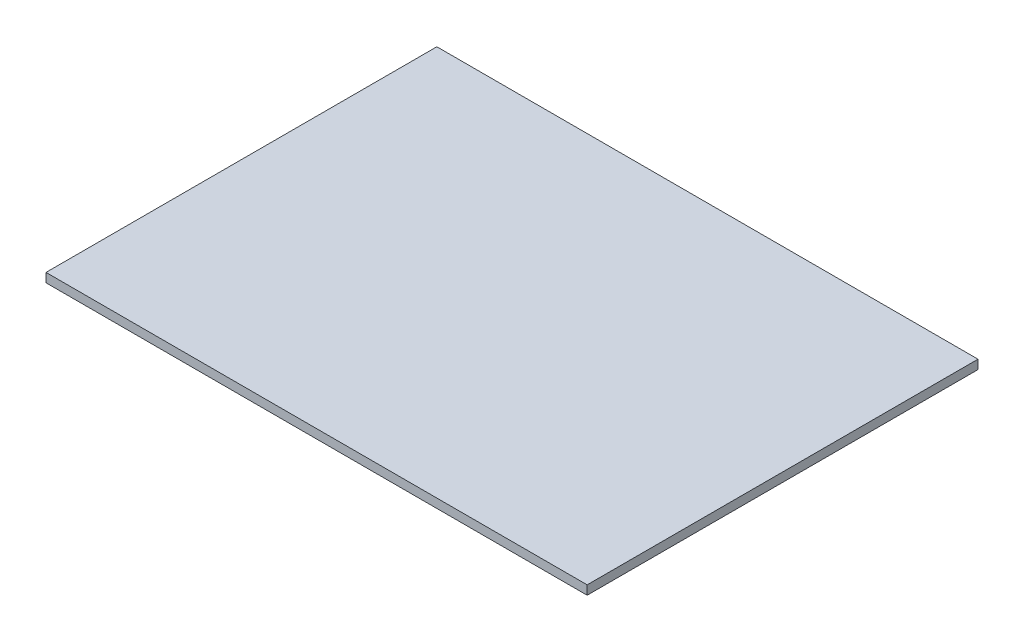
ISO-10303-21;
HEADER;
FILE_DESCRIPTION(('STEP AP214'),'2;1');
FILE_NAME('part.step','',(''),(''),'','','');
FILE_SCHEMA(('AUTOMOTIVE_DESIGN { 1 0 10303 214 1 1 1 1 }'));
ENDSEC;
DATA;
#1=APPLICATION_CONTEXT('core data for automotive mechanical design processes');
#2=APPLICATION_PROTOCOL_DEFINITION('international standard','automotive_design',2000,#1);
#3=PRODUCT_CONTEXT('',#1,'mechanical');
#4=PRODUCT('Part','Part','',(#3));
#5=PRODUCT_RELATED_PRODUCT_CATEGORY('part','',(#4));
#6=PRODUCT_DEFINITION_FORMATION('','',#4);
#7=PRODUCT_DEFINITION_CONTEXT('part definition',#1,'design');
#8=PRODUCT_DEFINITION('design','',#6,#7);
#9=PRODUCT_DEFINITION_SHAPE('','',#8);
#10=(LENGTH_UNIT() NAMED_UNIT(*) SI_UNIT(.MILLI.,.METRE.));
#11=(NAMED_UNIT(*) PLANE_ANGLE_UNIT() SI_UNIT($,.RADIAN.));
#12=(NAMED_UNIT(*) SI_UNIT($,.STERADIAN.) SOLID_ANGLE_UNIT());
#13=UNCERTAINTY_MEASURE_WITH_UNIT(LENGTH_MEASURE(1.E-05),#10,'distance_accuracy_value','');
#14=(GEOMETRIC_REPRESENTATION_CONTEXT(3) GLOBAL_UNCERTAINTY_ASSIGNED_CONTEXT((#13)) GLOBAL_UNIT_ASSIGNED_CONTEXT((#10,
#11,#12)) REPRESENTATION_CONTEXT('',''));
#15=CARTESIAN_POINT('',(0.,0.,0.));
#16=DIRECTION('',(0.,0.,1.));
#17=DIRECTION('',(1.,0.,0.));
#18=AXIS2_PLACEMENT_3D('',#15,#16,#17);
#19=CARTESIAN_POINT('',(450.,0.,325.));
#20=DIRECTION('',(-1.,0.,0.));
#21=DIRECTION('',(0.,0.,1.));
#22=AXIS2_PLACEMENT_3D('',#19,#20,#21);
#23=PLANE('',#22);
#24=DIRECTION('',(0.,1.,0.));
#25=VECTOR('',#24,1.);
#26=CARTESIAN_POINT('',(450.,0.,-325.));
#27=LINE('',#26,#25);
#28=CARTESIAN_POINT('',(450.,0.,-325.));
#29=VERTEX_POINT('',#28);
#30=CARTESIAN_POINT('',(450.,15.,-325.));
#31=VERTEX_POINT('',#30);
#32=EDGE_CURVE('E98',#29,#31,#27,.T.);
#33=ORIENTED_EDGE('',*,*,#32,.T.);
#34=DIRECTION('',(0.,0.,-1.));
#35=VECTOR('',#34,1.);
#36=CARTESIAN_POINT('',(450.,15.,325.));
#37=LINE('',#36,#35);
#38=CARTESIAN_POINT('',(450.,15.,325.));
#39=VERTEX_POINT('',#38);
#40=EDGE_CURVE('E11',#39,#31,#37,.T.);
#41=ORIENTED_EDGE('',*,*,#40,.F.);
#42=DIRECTION('',(0.,1.,0.));
#43=VECTOR('',#42,1.);
#44=CARTESIAN_POINT('',(450.,0.,325.));
#45=LINE('',#44,#43);
#46=CARTESIAN_POINT('',(450.,0.,325.));
#47=VERTEX_POINT('',#46);
#48=EDGE_CURVE('E75',#47,#39,#45,.T.);
#49=ORIENTED_EDGE('',*,*,#48,.F.);
#50=DIRECTION('',(0.,0.,-1.));
#51=VECTOR('',#50,1.);
#52=CARTESIAN_POINT('',(450.,0.,325.));
#53=LINE('',#52,#51);
#54=EDGE_CURVE('E51',#47,#29,#53,.T.);
#55=ORIENTED_EDGE('',*,*,#54,.T.);
#56=EDGE_LOOP('',(#33,#41,#49,#55));
#57=FACE_BOUND('',#56,.T.);
#58=ADVANCED_FACE('F35',(#57),#23,.F.);
#59=CARTESIAN_POINT('',(-450.,15.,325.));
#60=DIRECTION('',(0.,1.,0.));
#61=DIRECTION('',(0.,0.,1.));
#62=AXIS2_PLACEMENT_3D('',#59,#60,#61);
#63=PLANE('',#62);
#64=DIRECTION('',(1.,0.,0.));
#65=VECTOR('',#64,1.);
#66=CARTESIAN_POINT('',(-450.,15.,-325.));
#67=LINE('',#66,#65);
#68=CARTESIAN_POINT('',(-450.,15.,-325.));
#69=VERTEX_POINT('',#68);
#70=EDGE_CURVE('E84',#69,#31,#67,.T.);
#71=ORIENTED_EDGE('',*,*,#70,.F.);
#72=DIRECTION('',(0.,0.,-1.));
#73=VECTOR('',#72,1.);
#74=CARTESIAN_POINT('',(-450.,15.,325.));
#75=LINE('',#74,#73);
#76=CARTESIAN_POINT('',(-450.,15.,325.));
#77=VERTEX_POINT('',#76);
#78=EDGE_CURVE('E43',#77,#69,#75,.T.);
#79=ORIENTED_EDGE('',*,*,#78,.F.);
#80=DIRECTION('',(1.,0.,0.));
#81=VECTOR('',#80,1.);
#82=CARTESIAN_POINT('',(-450.,15.,325.));
#83=LINE('',#82,#81);
#84=EDGE_CURVE('E82',#77,#39,#83,.T.);
#85=ORIENTED_EDGE('',*,*,#84,.T.);
#86=ORIENTED_EDGE('',*,*,#40,.T.);
#87=EDGE_LOOP('',(#71,#79,#85,#86));
#88=FACE_BOUND('',#87,.T.);
#89=ADVANCED_FACE('F81',(#88),#63,.T.);
#90=CARTESIAN_POINT('',(-450.,0.,325.));
#91=DIRECTION('',(-1.,0.,0.));
#92=DIRECTION('',(0.,0.,1.));
#93=AXIS2_PLACEMENT_3D('',#90,#91,#92);
#94=PLANE('',#93);
#95=DIRECTION('',(0.,1.,0.));
#96=VECTOR('',#95,1.);
#97=CARTESIAN_POINT('',(-450.,0.,-325.));
#98=LINE('',#97,#96);
#99=CARTESIAN_POINT('',(-450.,0.,-325.));
#100=VERTEX_POINT('',#99);
#101=EDGE_CURVE('E101',#100,#69,#98,.T.);
#102=ORIENTED_EDGE('',*,*,#101,.F.);
#103=DIRECTION('',(0.,0.,-1.));
#104=VECTOR('',#103,1.);
#105=CARTESIAN_POINT('',(-450.,0.,325.));
#106=LINE('',#105,#104);
#107=CARTESIAN_POINT('',(-450.,0.,325.));
#108=VERTEX_POINT('',#107);
#109=EDGE_CURVE('E64',#108,#100,#106,.T.);
#110=ORIENTED_EDGE('',*,*,#109,.F.);
#111=DIRECTION('',(0.,1.,0.));
#112=VECTOR('',#111,1.);
#113=CARTESIAN_POINT('',(-450.,0.,325.));
#114=LINE('',#113,#112);
#115=EDGE_CURVE('E90',#108,#77,#114,.T.);
#116=ORIENTED_EDGE('',*,*,#115,.T.);
#117=ORIENTED_EDGE('',*,*,#78,.T.);
#118=EDGE_LOOP('',(#102,#110,#116,#117));
#119=FACE_BOUND('',#118,.T.);
#120=ADVANCED_FACE('F92',(#119),#94,.T.);
#121=CARTESIAN_POINT('',(450.,0.,325.));
#122=DIRECTION('',(0.,-1.,0.));
#123=DIRECTION('',(0.,0.,-1.));
#124=AXIS2_PLACEMENT_3D('',#121,#122,#123);
#125=PLANE('',#124);
#126=DIRECTION('',(-1.,0.,0.));
#127=VECTOR('',#126,1.);
#128=CARTESIAN_POINT('',(450.,0.,-325.));
#129=LINE('',#128,#127);
#130=EDGE_CURVE('E103',#29,#100,#129,.T.);
#131=ORIENTED_EDGE('',*,*,#130,.F.);
#132=ORIENTED_EDGE('',*,*,#54,.F.);
#133=DIRECTION('',(-1.,0.,0.));
#134=VECTOR('',#133,1.);
#135=CARTESIAN_POINT('',(450.,0.,325.));
#136=LINE('',#135,#134);
#137=EDGE_CURVE('E93',#47,#108,#136,.T.);
#138=ORIENTED_EDGE('',*,*,#137,.T.);
#139=ORIENTED_EDGE('',*,*,#109,.T.);
#140=EDGE_LOOP('',(#131,#132,#138,#139));
#141=FACE_BOUND('',#140,.T.);
#142=ADVANCED_FACE('F109',(#141),#125,.T.);
#143=CARTESIAN_POINT('',(0.,0.,325.));
#144=DIRECTION('',(0.,0.,-1.));
#145=DIRECTION('',(-1.,0.,0.));
#146=AXIS2_PLACEMENT_3D('',#143,#144,#145);
#147=PLANE('',#146);
#148=ORIENTED_EDGE('',*,*,#48,.T.);
#149=ORIENTED_EDGE('',*,*,#84,.F.);
#150=ORIENTED_EDGE('',*,*,#115,.F.);
#151=ORIENTED_EDGE('',*,*,#137,.F.);
#152=EDGE_LOOP('',(#148,#149,#150,#151));
#153=FACE_BOUND('',#152,.T.);
#154=ADVANCED_FACE('F89',(#153),#147,.F.);
#155=CARTESIAN_POINT('',(0.,0.,-325.));
#156=DIRECTION('',(0.,0.,-1.));
#157=DIRECTION('',(-1.,0.,0.));
#158=AXIS2_PLACEMENT_3D('',#155,#156,#157);
#159=PLANE('',#158);
#160=ORIENTED_EDGE('',*,*,#32,.F.);
#161=ORIENTED_EDGE('',*,*,#130,.T.);
#162=ORIENTED_EDGE('',*,*,#101,.T.);
#163=ORIENTED_EDGE('',*,*,#70,.T.);
#164=EDGE_LOOP('',(#160,#161,#162,#163));
#165=FACE_BOUND('',#164,.T.);
#166=ADVANCED_FACE('F108',(#165),#159,.T.);
#167=CLOSED_SHELL('',(#58,#89,#120,#142,#154,#166));
#168=MANIFOLD_SOLID_BREP('B2',#167);
#169=ADVANCED_BREP_SHAPE_REPRESENTATION('',(#18,#168),#14);
#170=SHAPE_DEFINITION_REPRESENTATION(#9,#169);
ENDSEC;
END-ISO-10303-21;
